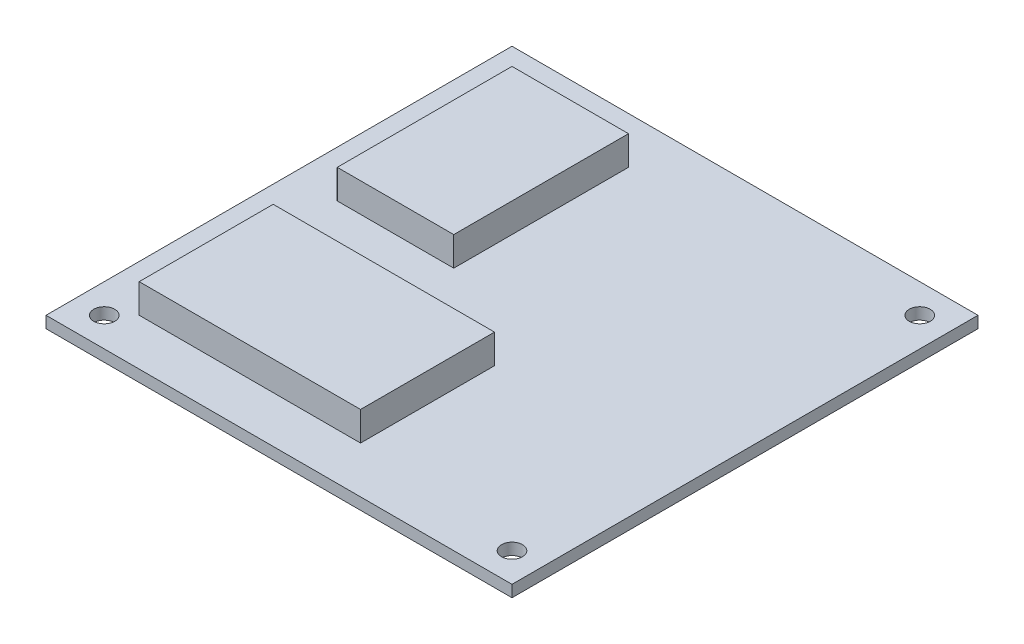
ISO-10303-21;
HEADER;
FILE_DESCRIPTION(('STEP AP214'),'2;1');
FILE_NAME('part.step','',(''),(''),'','','');
FILE_SCHEMA(('AUTOMOTIVE_DESIGN { 1 0 10303 214 1 1 1 1 }'));
ENDSEC;
DATA;
#1=APPLICATION_CONTEXT('core data for automotive mechanical design processes');
#2=APPLICATION_PROTOCOL_DEFINITION('international standard','automotive_design',2000,#1);
#3=PRODUCT_CONTEXT('',#1,'mechanical');
#4=PRODUCT('Part','Part','',(#3));
#5=PRODUCT_RELATED_PRODUCT_CATEGORY('part','',(#4));
#6=PRODUCT_DEFINITION_FORMATION('','',#4);
#7=PRODUCT_DEFINITION_CONTEXT('part definition',#1,'design');
#8=PRODUCT_DEFINITION('design','',#6,#7);
#9=PRODUCT_DEFINITION_SHAPE('','',#8);
#10=(LENGTH_UNIT() NAMED_UNIT(*) SI_UNIT(.MILLI.,.METRE.));
#11=(NAMED_UNIT(*) PLANE_ANGLE_UNIT() SI_UNIT($,.RADIAN.));
#12=(NAMED_UNIT(*) SI_UNIT($,.STERADIAN.) SOLID_ANGLE_UNIT());
#13=UNCERTAINTY_MEASURE_WITH_UNIT(LENGTH_MEASURE(1.E-05),#10,'distance_accuracy_value','');
#14=(GEOMETRIC_REPRESENTATION_CONTEXT(3) GLOBAL_UNCERTAINTY_ASSIGNED_CONTEXT((#13)) GLOBAL_UNIT_ASSIGNED_CONTEXT((#10,
#11,#12)) REPRESENTATION_CONTEXT('',''));
#15=CARTESIAN_POINT('',(0.,0.,0.));
#16=DIRECTION('',(0.,0.,1.));
#17=DIRECTION('',(1.,0.,0.));
#18=AXIS2_PLACEMENT_3D('',#15,#16,#17);
#19=CARTESIAN_POINT('',(0.,2.,0.));
#20=DIRECTION('',(0.,-1.,0.));
#21=DIRECTION('',(0.,0.,-1.));
#22=AXIS2_PLACEMENT_3D('',#19,#20,#21);
#23=PLANE('',#22);
#24=DIRECTION('',(0.,0.,1.));
#25=VECTOR('',#24,1.);
#26=CARTESIAN_POINT('',(8.,2.,-72.));
#27=LINE('',#26,#25);
#28=CARTESIAN_POINT('',(8.,2.,-72.));
#29=VERTEX_POINT('',#28);
#30=CARTESIAN_POINT('',(8.00000000000001,2.,-42.));
#31=VERTEX_POINT('',#30);
#32=EDGE_CURVE('E143',#29,#31,#27,.T.);
#33=ORIENTED_EDGE('',*,*,#32,.F.);
#34=DIRECTION('',(-1.,0.,0.));
#35=VECTOR('',#34,1.);
#36=CARTESIAN_POINT('',(8.,2.,-72.));
#37=LINE('',#36,#35);
#38=CARTESIAN_POINT('',(28.,2.,-72.));
#39=VERTEX_POINT('',#38);
#40=EDGE_CURVE('E156',#39,#29,#37,.T.);
#41=ORIENTED_EDGE('',*,*,#40,.F.);
#42=DIRECTION('',(0.,0.,-1.));
#43=VECTOR('',#42,1.);
#44=CARTESIAN_POINT('',(28.,2.,-72.));
#45=LINE('',#44,#43);
#46=CARTESIAN_POINT('',(28.,2.,-42.));
#47=VERTEX_POINT('',#46);
#48=EDGE_CURVE('E165',#47,#39,#45,.T.);
#49=ORIENTED_EDGE('',*,*,#48,.F.);
#50=DIRECTION('',(1.,0.,0.));
#51=VECTOR('',#50,1.);
#52=CARTESIAN_POINT('',(8.00000000000001,2.,-42.));
#53=LINE('',#52,#51);
#54=EDGE_CURVE('E146',#31,#47,#53,.T.);
#55=ORIENTED_EDGE('',*,*,#54,.F.);
#56=EDGE_LOOP('',(#33,#41,#49,#55));
#57=FACE_BOUND('',#56,.T.);
#58=CARTESIAN_POINT('',(75.,2.,-75.));
#59=DIRECTION('',(0.,1.,0.));
#60=DIRECTION('',(0.,0.,1.));
#61=AXIS2_PLACEMENT_3D('',#58,#59,#60);
#62=CIRCLE('',#61,1.8);
#63=CARTESIAN_POINT('',(75.,2.,-73.2));
#64=VERTEX_POINT('',#63);
#65=EDGE_CURVE('E184',#64,#64,#62,.T.);
#66=ORIENTED_EDGE('',*,*,#65,.F.);
#67=EDGE_LOOP('',(#66));
#68=FACE_BOUND('',#67,.T.);
#69=CARTESIAN_POINT('',(5.,2.,-75.));
#70=DIRECTION('',(0.,1.,0.));
#71=DIRECTION('',(0.,0.,1.));
#72=AXIS2_PLACEMENT_3D('',#69,#70,#71);
#73=CIRCLE('',#72,1.8);
#74=CARTESIAN_POINT('',(5.,2.,-73.2));
#75=VERTEX_POINT('',#74);
#76=EDGE_CURVE('E187',#75,#75,#73,.T.);
#77=ORIENTED_EDGE('',*,*,#76,.F.);
#78=EDGE_LOOP('',(#77));
#79=FACE_BOUND('',#78,.T.);
#80=DIRECTION('',(0.,0.,1.));
#81=VECTOR('',#80,1.);
#82=CARTESIAN_POINT('',(0.,2.,0.));
#83=LINE('',#82,#81);
#84=CARTESIAN_POINT('',(0.,2.,-80.));
#85=VERTEX_POINT('',#84);
#86=CARTESIAN_POINT('',(0.,2.,0.));
#87=VERTEX_POINT('',#86);
#88=EDGE_CURVE('E194',#85,#87,#83,.T.);
#89=ORIENTED_EDGE('',*,*,#88,.T.);
#90=DIRECTION('',(1.,0.,0.));
#91=VECTOR('',#90,1.);
#92=CARTESIAN_POINT('',(0.,2.,0.));
#93=LINE('',#92,#91);
#94=CARTESIAN_POINT('',(80.,2.,0.));
#95=VERTEX_POINT('',#94);
#96=EDGE_CURVE('E197',#87,#95,#93,.T.);
#97=ORIENTED_EDGE('',*,*,#96,.T.);
#98=DIRECTION('',(0.,0.,-1.));
#99=VECTOR('',#98,1.);
#100=CARTESIAN_POINT('',(80.,2.,0.));
#101=LINE('',#100,#99);
#102=CARTESIAN_POINT('',(80.,2.,-80.));
#103=VERTEX_POINT('',#102);
#104=EDGE_CURVE('E200',#95,#103,#101,.T.);
#105=ORIENTED_EDGE('',*,*,#104,.T.);
#106=DIRECTION('',(-1.,0.,0.));
#107=VECTOR('',#106,1.);
#108=CARTESIAN_POINT('',(0.,2.,-80.));
#109=LINE('',#108,#107);
#110=EDGE_CURVE('E202',#103,#85,#109,.T.);
#111=ORIENTED_EDGE('',*,*,#110,.T.);
#112=EDGE_LOOP('',(#89,#97,#105,#111));
#113=FACE_BOUND('',#112,.T.);
#114=CARTESIAN_POINT('',(5.,2.,-4.99999999999999));
#115=DIRECTION('',(0.,1.,0.));
#116=DIRECTION('',(0.,0.,1.));
#117=AXIS2_PLACEMENT_3D('',#114,#115,#116);
#118=CIRCLE('',#117,1.8);
#119=CARTESIAN_POINT('',(5.,2.,-3.19999999999999));
#120=VERTEX_POINT('',#119);
#121=EDGE_CURVE('E226',#120,#120,#118,.T.);
#122=ORIENTED_EDGE('',*,*,#121,.F.);
#123=EDGE_LOOP('',(#122));
#124=FACE_BOUND('',#123,.T.);
#125=CARTESIAN_POINT('',(75.,2.,-4.99999999999999));
#126=DIRECTION('',(0.,1.,0.));
#127=DIRECTION('',(0.,0.,1.));
#128=AXIS2_PLACEMENT_3D('',#125,#126,#127);
#129=CIRCLE('',#128,1.8);
#130=CARTESIAN_POINT('',(75.,2.,-3.19999999999999));
#131=VERTEX_POINT('',#130);
#132=EDGE_CURVE('E11',#131,#131,#129,.T.);
#133=ORIENTED_EDGE('',*,*,#132,.F.);
#134=EDGE_LOOP('',(#133));
#135=FACE_BOUND('',#134,.T.);
#136=DIRECTION('',(0.,0.,1.));
#137=VECTOR('',#136,1.);
#138=CARTESIAN_POINT('',(7.99999999999999,2.,-31.));
#139=LINE('',#138,#137);
#140=CARTESIAN_POINT('',(7.99999999999999,2.,-31.));
#141=VERTEX_POINT('',#140);
#142=CARTESIAN_POINT('',(8.,2.,-8.));
#143=VERTEX_POINT('',#142);
#144=EDGE_CURVE('E142',#141,#143,#139,.T.);
#145=ORIENTED_EDGE('',*,*,#144,.F.);
#146=DIRECTION('',(-1.,0.,0.));
#147=VECTOR('',#146,1.);
#148=CARTESIAN_POINT('',(7.99999999999999,2.,-31.));
#149=LINE('',#148,#147);
#150=CARTESIAN_POINT('',(46.,2.,-31.));
#151=VERTEX_POINT('',#150);
#152=EDGE_CURVE('E139',#151,#141,#149,.T.);
#153=ORIENTED_EDGE('',*,*,#152,.F.);
#154=DIRECTION('',(0.,0.,-1.));
#155=VECTOR('',#154,1.);
#156=CARTESIAN_POINT('',(46.,2.,-31.));
#157=LINE('',#156,#155);
#158=CARTESIAN_POINT('',(46.,2.,-8.));
#159=VERTEX_POINT('',#158);
#160=EDGE_CURVE('E53',#159,#151,#157,.T.);
#161=ORIENTED_EDGE('',*,*,#160,.F.);
#162=DIRECTION('',(1.,0.,0.));
#163=VECTOR('',#162,1.);
#164=CARTESIAN_POINT('',(8.,2.,-8.));
#165=LINE('',#164,#163);
#166=EDGE_CURVE('E48',#143,#159,#165,.T.);
#167=ORIENTED_EDGE('',*,*,#166,.F.);
#168=EDGE_LOOP('',(#145,#153,#161,#167));
#169=FACE_BOUND('',#168,.T.);
#170=ADVANCED_FACE('F33',(#57,#68,#79,#113,#124,#135,#169),#23,.F.);
#171=CARTESIAN_POINT('',(0.,2.,0.));
#172=DIRECTION('',(1.,0.,0.));
#173=DIRECTION('',(0.,0.,-1.));
#174=AXIS2_PLACEMENT_3D('',#171,#172,#173);
#175=PLANE('',#174);
#176=DIRECTION('',(0.,0.,1.));
#177=VECTOR('',#176,1.);
#178=CARTESIAN_POINT('',(0.,0.,0.));
#179=LINE('',#178,#177);
#180=CARTESIAN_POINT('',(0.,0.,-80.));
#181=VERTEX_POINT('',#180);
#182=CARTESIAN_POINT('',(0.,0.,0.));
#183=VERTEX_POINT('',#182);
#184=EDGE_CURVE('E191',#181,#183,#179,.T.);
#185=ORIENTED_EDGE('',*,*,#184,.T.);
#186=DIRECTION('',(0.,-1.,0.));
#187=VECTOR('',#186,1.);
#188=CARTESIAN_POINT('',(0.,2.,0.));
#189=LINE('',#188,#187);
#190=EDGE_CURVE('E220',#87,#183,#189,.T.);
#191=ORIENTED_EDGE('',*,*,#190,.F.);
#192=ORIENTED_EDGE('',*,*,#88,.F.);
#193=DIRECTION('',(0.,-1.,0.));
#194=VECTOR('',#193,1.);
#195=CARTESIAN_POINT('',(0.,2.,-80.));
#196=LINE('',#195,#194);
#197=EDGE_CURVE('E204',#85,#181,#196,.T.);
#198=ORIENTED_EDGE('',*,*,#197,.T.);
#199=EDGE_LOOP('',(#185,#191,#192,#198));
#200=FACE_BOUND('',#199,.T.);
#201=ADVANCED_FACE('F240',(#200),#175,.F.);
#202=CARTESIAN_POINT('',(0.,2.,0.));
#203=DIRECTION('',(0.,0.,-1.));
#204=DIRECTION('',(-1.,0.,0.));
#205=AXIS2_PLACEMENT_3D('',#202,#203,#204);
#206=PLANE('',#205);
#207=DIRECTION('',(1.,0.,0.));
#208=VECTOR('',#207,1.);
#209=CARTESIAN_POINT('',(0.,0.,0.));
#210=LINE('',#209,#208);
#211=CARTESIAN_POINT('',(80.,0.,0.));
#212=VERTEX_POINT('',#211);
#213=EDGE_CURVE('E207',#183,#212,#210,.T.);
#214=ORIENTED_EDGE('',*,*,#213,.T.);
#215=DIRECTION('',(0.,-1.,0.));
#216=VECTOR('',#215,1.);
#217=CARTESIAN_POINT('',(80.,2.,0.));
#218=LINE('',#217,#216);
#219=EDGE_CURVE('E217',#95,#212,#218,.T.);
#220=ORIENTED_EDGE('',*,*,#219,.F.);
#221=ORIENTED_EDGE('',*,*,#96,.F.);
#222=ORIENTED_EDGE('',*,*,#190,.T.);
#223=EDGE_LOOP('',(#214,#220,#221,#222));
#224=FACE_BOUND('',#223,.T.);
#225=ADVANCED_FACE('F307',(#224),#206,.F.);
#226=CARTESIAN_POINT('',(80.,2.,0.));
#227=DIRECTION('',(-1.,0.,0.));
#228=DIRECTION('',(0.,0.,1.));
#229=AXIS2_PLACEMENT_3D('',#226,#227,#228);
#230=PLANE('',#229);
#231=DIRECTION('',(0.,0.,-1.));
#232=VECTOR('',#231,1.);
#233=CARTESIAN_POINT('',(80.,0.,0.));
#234=LINE('',#233,#232);
#235=CARTESIAN_POINT('',(80.,0.,-80.));
#236=VERTEX_POINT('',#235);
#237=EDGE_CURVE('E209',#212,#236,#234,.T.);
#238=ORIENTED_EDGE('',*,*,#237,.T.);
#239=DIRECTION('',(0.,-1.,0.));
#240=VECTOR('',#239,1.);
#241=CARTESIAN_POINT('',(80.,2.,-80.));
#242=LINE('',#241,#240);
#243=EDGE_CURVE('E214',#103,#236,#242,.T.);
#244=ORIENTED_EDGE('',*,*,#243,.F.);
#245=ORIENTED_EDGE('',*,*,#104,.F.);
#246=ORIENTED_EDGE('',*,*,#219,.T.);
#247=EDGE_LOOP('',(#238,#244,#245,#246));
#248=FACE_BOUND('',#247,.T.);
#249=ADVANCED_FACE('F303',(#248),#230,.F.);
#250=CARTESIAN_POINT('',(0.,2.,-80.));
#251=DIRECTION('',(0.,0.,1.));
#252=DIRECTION('',(1.,0.,0.));
#253=AXIS2_PLACEMENT_3D('',#250,#251,#252);
#254=PLANE('',#253);
#255=DIRECTION('',(-1.,0.,0.));
#256=VECTOR('',#255,1.);
#257=CARTESIAN_POINT('',(0.,0.,-80.));
#258=LINE('',#257,#256);
#259=EDGE_CURVE('E198',#236,#181,#258,.T.);
#260=ORIENTED_EDGE('',*,*,#259,.T.);
#261=ORIENTED_EDGE('',*,*,#197,.F.);
#262=ORIENTED_EDGE('',*,*,#110,.F.);
#263=ORIENTED_EDGE('',*,*,#243,.T.);
#264=EDGE_LOOP('',(#260,#261,#262,#263));
#265=FACE_BOUND('',#264,.T.);
#266=ADVANCED_FACE('F299',(#265),#254,.F.);
#267=CARTESIAN_POINT('',(0.,0.,0.));
#268=DIRECTION('',(0.,-1.,0.));
#269=DIRECTION('',(0.,0.,-1.));
#270=AXIS2_PLACEMENT_3D('',#267,#268,#269);
#271=PLANE('',#270);
#272=CARTESIAN_POINT('',(75.,0.,-75.));
#273=DIRECTION('',(0.,1.,0.));
#274=DIRECTION('',(0.,0.,1.));
#275=AXIS2_PLACEMENT_3D('',#272,#273,#274);
#276=CIRCLE('',#275,1.8);
#277=CARTESIAN_POINT('',(75.,0.,-73.2));
#278=VERTEX_POINT('',#277);
#279=EDGE_CURVE('E181',#278,#278,#276,.T.);
#280=ORIENTED_EDGE('',*,*,#279,.T.);
#281=EDGE_LOOP('',(#280));
#282=FACE_BOUND('',#281,.T.);
#283=CARTESIAN_POINT('',(5.,0.,-75.));
#284=DIRECTION('',(0.,1.,0.));
#285=DIRECTION('',(0.,0.,1.));
#286=AXIS2_PLACEMENT_3D('',#283,#284,#285);
#287=CIRCLE('',#286,1.8);
#288=CARTESIAN_POINT('',(5.,0.,-73.2));
#289=VERTEX_POINT('',#288);
#290=EDGE_CURVE('E188',#289,#289,#287,.T.);
#291=ORIENTED_EDGE('',*,*,#290,.T.);
#292=EDGE_LOOP('',(#291));
#293=FACE_BOUND('',#292,.T.);
#294=ORIENTED_EDGE('',*,*,#184,.F.);
#295=ORIENTED_EDGE('',*,*,#259,.F.);
#296=ORIENTED_EDGE('',*,*,#237,.F.);
#297=ORIENTED_EDGE('',*,*,#213,.F.);
#298=EDGE_LOOP('',(#294,#295,#296,#297));
#299=FACE_BOUND('',#298,.T.);
#300=CARTESIAN_POINT('',(5.,0.,-4.99999999999999));
#301=DIRECTION('',(0.,1.,0.));
#302=DIRECTION('',(0.,0.,1.));
#303=AXIS2_PLACEMENT_3D('',#300,#301,#302);
#304=CIRCLE('',#303,1.8);
#305=CARTESIAN_POINT('',(5.,0.,-3.19999999999999));
#306=VERTEX_POINT('',#305);
#307=EDGE_CURVE('E223',#306,#306,#304,.T.);
#308=ORIENTED_EDGE('',*,*,#307,.T.);
#309=EDGE_LOOP('',(#308));
#310=FACE_BOUND('',#309,.T.);
#311=CARTESIAN_POINT('',(75.,0.,-4.99999999999999));
#312=DIRECTION('',(0.,1.,0.));
#313=DIRECTION('',(0.,0.,1.));
#314=AXIS2_PLACEMENT_3D('',#311,#312,#313);
#315=CIRCLE('',#314,1.8);
#316=CARTESIAN_POINT('',(75.,0.,-3.19999999999999));
#317=VERTEX_POINT('',#316);
#318=EDGE_CURVE('E41',#317,#317,#315,.T.);
#319=ORIENTED_EDGE('',*,*,#318,.T.);
#320=EDGE_LOOP('',(#319));
#321=FACE_BOUND('',#320,.T.);
#322=ADVANCED_FACE('F231',(#282,#293,#299,#310,#321),#271,.T.);
#323=CARTESIAN_POINT('',(5.,0.,-75.));
#324=DIRECTION('',(0.,1.,0.));
#325=DIRECTION('',(0.,0.,1.));
#326=AXIS2_PLACEMENT_3D('',#323,#324,#325);
#327=CYLINDRICAL_SURFACE('',#326,1.8);
#328=ORIENTED_EDGE('',*,*,#290,.F.);
#329=EDGE_LOOP('',(#328));
#330=FACE_BOUND('',#329,.T.);
#331=ORIENTED_EDGE('',*,*,#76,.T.);
#332=EDGE_LOOP('',(#331));
#333=FACE_BOUND('',#332,.T.);
#334=ADVANCED_FACE('F292',(#330,#333),#327,.F.);
#335=CARTESIAN_POINT('',(75.,0.,-75.));
#336=DIRECTION('',(0.,1.,0.));
#337=DIRECTION('',(0.,0.,1.));
#338=AXIS2_PLACEMENT_3D('',#335,#336,#337);
#339=CYLINDRICAL_SURFACE('',#338,1.8);
#340=ORIENTED_EDGE('',*,*,#279,.F.);
#341=EDGE_LOOP('',(#340));
#342=FACE_BOUND('',#341,.T.);
#343=ORIENTED_EDGE('',*,*,#65,.T.);
#344=EDGE_LOOP('',(#343));
#345=FACE_BOUND('',#344,.T.);
#346=ADVANCED_FACE('F289',(#342,#345),#339,.F.);
#347=CARTESIAN_POINT('',(5.,0.,-4.99999999999999));
#348=DIRECTION('',(0.,1.,0.));
#349=DIRECTION('',(0.,0.,1.));
#350=AXIS2_PLACEMENT_3D('',#347,#348,#349);
#351=CYLINDRICAL_SURFACE('',#350,1.8);
#352=ORIENTED_EDGE('',*,*,#307,.F.);
#353=EDGE_LOOP('',(#352));
#354=FACE_BOUND('',#353,.T.);
#355=ORIENTED_EDGE('',*,*,#121,.T.);
#356=EDGE_LOOP('',(#355));
#357=FACE_BOUND('',#356,.T.);
#358=ADVANCED_FACE('F236',(#354,#357),#351,.F.);
#359=CARTESIAN_POINT('',(75.,0.,-4.99999999999999));
#360=DIRECTION('',(0.,1.,0.));
#361=DIRECTION('',(0.,0.,1.));
#362=AXIS2_PLACEMENT_3D('',#359,#360,#361);
#363=CYLINDRICAL_SURFACE('',#362,1.8);
#364=ORIENTED_EDGE('',*,*,#318,.F.);
#365=EDGE_LOOP('',(#364));
#366=FACE_BOUND('',#365,.T.);
#367=ORIENTED_EDGE('',*,*,#132,.T.);
#368=EDGE_LOOP('',(#367));
#369=FACE_BOUND('',#368,.T.);
#370=ADVANCED_FACE('F35',(#366,#369),#363,.F.);
#371=CARTESIAN_POINT('',(8.,7.,-72.));
#372=DIRECTION('',(1.,0.,0.));
#373=DIRECTION('',(0.,0.,-1.));
#374=AXIS2_PLACEMENT_3D('',#371,#372,#373);
#375=PLANE('',#374);
#376=ORIENTED_EDGE('',*,*,#32,.T.);
#377=DIRECTION('',(0.,-1.,0.));
#378=VECTOR('',#377,1.);
#379=CARTESIAN_POINT('',(8.00000000000001,7.,-42.));
#380=LINE('',#379,#378);
#381=CARTESIAN_POINT('',(8.00000000000001,7.,-42.));
#382=VERTEX_POINT('',#381);
#383=EDGE_CURVE('E178',#382,#31,#380,.T.);
#384=ORIENTED_EDGE('',*,*,#383,.F.);
#385=DIRECTION('',(0.,0.,1.));
#386=VECTOR('',#385,1.);
#387=CARTESIAN_POINT('',(8.,7.,-72.));
#388=LINE('',#387,#386);
#389=CARTESIAN_POINT('',(8.,7.,-72.));
#390=VERTEX_POINT('',#389);
#391=EDGE_CURVE('E152',#390,#382,#388,.T.);
#392=ORIENTED_EDGE('',*,*,#391,.F.);
#393=DIRECTION('',(0.,-1.,0.));
#394=VECTOR('',#393,1.);
#395=CARTESIAN_POINT('',(8.,7.,-72.));
#396=LINE('',#395,#394);
#397=EDGE_CURVE('E161',#390,#29,#396,.T.);
#398=ORIENTED_EDGE('',*,*,#397,.T.);
#399=EDGE_LOOP('',(#376,#384,#392,#398));
#400=FACE_BOUND('',#399,.T.);
#401=ADVANCED_FACE('F235',(#400),#375,.F.);
#402=CARTESIAN_POINT('',(8.00000000000001,7.,-42.));
#403=DIRECTION('',(0.,0.,-1.));
#404=DIRECTION('',(-1.,0.,0.));
#405=AXIS2_PLACEMENT_3D('',#402,#403,#404);
#406=PLANE('',#405);
#407=ORIENTED_EDGE('',*,*,#54,.T.);
#408=DIRECTION('',(0.,-1.,0.));
#409=VECTOR('',#408,1.);
#410=CARTESIAN_POINT('',(28.,7.,-42.));
#411=LINE('',#410,#409);
#412=CARTESIAN_POINT('',(28.,7.,-42.));
#413=VERTEX_POINT('',#412);
#414=EDGE_CURVE('E175',#413,#47,#411,.T.);
#415=ORIENTED_EDGE('',*,*,#414,.F.);
#416=DIRECTION('',(1.,0.,0.));
#417=VECTOR('',#416,1.);
#418=CARTESIAN_POINT('',(8.00000000000001,7.,-42.));
#419=LINE('',#418,#417);
#420=EDGE_CURVE('E155',#382,#413,#419,.T.);
#421=ORIENTED_EDGE('',*,*,#420,.F.);
#422=ORIENTED_EDGE('',*,*,#383,.T.);
#423=EDGE_LOOP('',(#407,#415,#421,#422));
#424=FACE_BOUND('',#423,.T.);
#425=ADVANCED_FACE('F281',(#424),#406,.F.);
#426=CARTESIAN_POINT('',(28.,7.,-72.));
#427=DIRECTION('',(-1.,0.,0.));
#428=DIRECTION('',(0.,0.,1.));
#429=AXIS2_PLACEMENT_3D('',#426,#427,#428);
#430=PLANE('',#429);
#431=ORIENTED_EDGE('',*,*,#48,.T.);
#432=DIRECTION('',(0.,-1.,0.));
#433=VECTOR('',#432,1.);
#434=CARTESIAN_POINT('',(28.,7.,-72.));
#435=LINE('',#434,#433);
#436=CARTESIAN_POINT('',(28.,7.,-72.));
#437=VERTEX_POINT('',#436);
#438=EDGE_CURVE('E172',#437,#39,#435,.T.);
#439=ORIENTED_EDGE('',*,*,#438,.F.);
#440=DIRECTION('',(0.,0.,-1.));
#441=VECTOR('',#440,1.);
#442=CARTESIAN_POINT('',(28.,7.,-72.));
#443=LINE('',#442,#441);
#444=EDGE_CURVE('E158',#413,#437,#443,.T.);
#445=ORIENTED_EDGE('',*,*,#444,.F.);
#446=ORIENTED_EDGE('',*,*,#414,.T.);
#447=EDGE_LOOP('',(#431,#439,#445,#446));
#448=FACE_BOUND('',#447,.T.);
#449=ADVANCED_FACE('F277',(#448),#430,.F.);
#450=CARTESIAN_POINT('',(8.,7.,-72.));
#451=DIRECTION('',(0.,0.,1.));
#452=DIRECTION('',(1.,0.,0.));
#453=AXIS2_PLACEMENT_3D('',#450,#451,#452);
#454=PLANE('',#453);
#455=ORIENTED_EDGE('',*,*,#40,.T.);
#456=ORIENTED_EDGE('',*,*,#397,.F.);
#457=DIRECTION('',(-1.,0.,0.));
#458=VECTOR('',#457,1.);
#459=CARTESIAN_POINT('',(8.,7.,-72.));
#460=LINE('',#459,#458);
#461=EDGE_CURVE('E160',#437,#390,#460,.T.);
#462=ORIENTED_EDGE('',*,*,#461,.F.);
#463=ORIENTED_EDGE('',*,*,#438,.T.);
#464=EDGE_LOOP('',(#455,#456,#462,#463));
#465=FACE_BOUND('',#464,.T.);
#466=ADVANCED_FACE('F273',(#465),#454,.F.);
#467=CARTESIAN_POINT('',(0.,7.,0.));
#468=DIRECTION('',(0.,1.,0.));
#469=DIRECTION('',(0.,0.,1.));
#470=AXIS2_PLACEMENT_3D('',#467,#468,#469);
#471=PLANE('',#470);
#472=ORIENTED_EDGE('',*,*,#391,.T.);
#473=ORIENTED_EDGE('',*,*,#420,.T.);
#474=ORIENTED_EDGE('',*,*,#444,.T.);
#475=ORIENTED_EDGE('',*,*,#461,.T.);
#476=EDGE_LOOP('',(#472,#473,#474,#475));
#477=FACE_BOUND('',#476,.T.);
#478=ADVANCED_FACE('F270',(#477),#471,.T.);
#479=CARTESIAN_POINT('',(7.99999999999999,7.,-31.));
#480=DIRECTION('',(1.,0.,0.));
#481=DIRECTION('',(0.,0.,-1.));
#482=AXIS2_PLACEMENT_3D('',#479,#480,#481);
#483=PLANE('',#482);
#484=ORIENTED_EDGE('',*,*,#144,.T.);
#485=DIRECTION('',(0.,-1.,0.));
#486=VECTOR('',#485,1.);
#487=CARTESIAN_POINT('',(8.,7.,-8.));
#488=LINE('',#487,#486);
#489=CARTESIAN_POINT('',(8.,7.,-8.));
#490=VERTEX_POINT('',#489);
#491=EDGE_CURVE('E123',#490,#143,#488,.T.);
#492=ORIENTED_EDGE('',*,*,#491,.F.);
#493=DIRECTION('',(0.,0.,1.));
#494=VECTOR('',#493,1.);
#495=CARTESIAN_POINT('',(7.99999999999999,7.,-31.));
#496=LINE('',#495,#494);
#497=CARTESIAN_POINT('',(7.99999999999999,7.,-31.));
#498=VERTEX_POINT('',#497);
#499=EDGE_CURVE('E130',#498,#490,#496,.T.);
#500=ORIENTED_EDGE('',*,*,#499,.F.);
#501=DIRECTION('',(0.,-1.,0.));
#502=VECTOR('',#501,1.);
#503=CARTESIAN_POINT('',(7.99999999999999,7.,-31.));
#504=LINE('',#503,#502);
#505=EDGE_CURVE('E248',#498,#141,#504,.T.);
#506=ORIENTED_EDGE('',*,*,#505,.T.);
#507=EDGE_LOOP('',(#484,#492,#500,#506));
#508=FACE_BOUND('',#507,.T.);
#509=ADVANCED_FACE('F141',(#508),#483,.F.);
#510=CARTESIAN_POINT('',(8.,7.,-8.));
#511=DIRECTION('',(0.,0.,-1.));
#512=DIRECTION('',(-1.,0.,0.));
#513=AXIS2_PLACEMENT_3D('',#510,#511,#512);
#514=PLANE('',#513);
#515=ORIENTED_EDGE('',*,*,#166,.T.);
#516=DIRECTION('',(0.,-1.,0.));
#517=VECTOR('',#516,1.);
#518=CARTESIAN_POINT('',(46.,7.,-8.));
#519=LINE('',#518,#517);
#520=CARTESIAN_POINT('',(46.,7.,-8.));
#521=VERTEX_POINT('',#520);
#522=EDGE_CURVE('E126',#521,#159,#519,.T.);
#523=ORIENTED_EDGE('',*,*,#522,.F.);
#524=DIRECTION('',(1.,0.,0.));
#525=VECTOR('',#524,1.);
#526=CARTESIAN_POINT('',(8.,7.,-8.));
#527=LINE('',#526,#525);
#528=EDGE_CURVE('E119',#490,#521,#527,.T.);
#529=ORIENTED_EDGE('',*,*,#528,.F.);
#530=ORIENTED_EDGE('',*,*,#491,.T.);
#531=EDGE_LOOP('',(#515,#523,#529,#530));
#532=FACE_BOUND('',#531,.T.);
#533=ADVANCED_FACE('F121',(#532),#514,.F.);
#534=CARTESIAN_POINT('',(46.,7.,-31.));
#535=DIRECTION('',(-1.,0.,0.));
#536=DIRECTION('',(0.,0.,1.));
#537=AXIS2_PLACEMENT_3D('',#534,#535,#536);
#538=PLANE('',#537);
#539=ORIENTED_EDGE('',*,*,#160,.T.);
#540=DIRECTION('',(0.,-1.,0.));
#541=VECTOR('',#540,1.);
#542=CARTESIAN_POINT('',(46.,7.,-31.));
#543=LINE('',#542,#541);
#544=CARTESIAN_POINT('',(46.,7.,-31.));
#545=VERTEX_POINT('',#544);
#546=EDGE_CURVE('E148',#545,#151,#543,.T.);
#547=ORIENTED_EDGE('',*,*,#546,.F.);
#548=DIRECTION('',(0.,0.,-1.));
#549=VECTOR('',#548,1.);
#550=CARTESIAN_POINT('',(46.,7.,-31.));
#551=LINE('',#550,#549);
#552=EDGE_CURVE('E129',#521,#545,#551,.T.);
#553=ORIENTED_EDGE('',*,*,#552,.F.);
#554=ORIENTED_EDGE('',*,*,#522,.T.);
#555=EDGE_LOOP('',(#539,#547,#553,#554));
#556=FACE_BOUND('',#555,.T.);
#557=ADVANCED_FACE('F257',(#556),#538,.F.);
#558=CARTESIAN_POINT('',(7.99999999999999,7.,-31.));
#559=DIRECTION('',(0.,0.,1.));
#560=DIRECTION('',(1.,0.,0.));
#561=AXIS2_PLACEMENT_3D('',#558,#559,#560);
#562=PLANE('',#561);
#563=ORIENTED_EDGE('',*,*,#152,.T.);
#564=ORIENTED_EDGE('',*,*,#505,.F.);
#565=DIRECTION('',(-1.,0.,0.));
#566=VECTOR('',#565,1.);
#567=CARTESIAN_POINT('',(7.99999999999999,7.,-31.));
#568=LINE('',#567,#566);
#569=EDGE_CURVE('E135',#545,#498,#568,.T.);
#570=ORIENTED_EDGE('',*,*,#569,.F.);
#571=ORIENTED_EDGE('',*,*,#546,.T.);
#572=EDGE_LOOP('',(#563,#564,#570,#571));
#573=FACE_BOUND('',#572,.T.);
#574=ADVANCED_FACE('F247',(#573),#562,.F.);
#575=CARTESIAN_POINT('',(0.,7.,0.));
#576=DIRECTION('',(0.,1.,0.));
#577=DIRECTION('',(0.,0.,1.));
#578=AXIS2_PLACEMENT_3D('',#575,#576,#577);
#579=PLANE('',#578);
#580=ORIENTED_EDGE('',*,*,#499,.T.);
#581=ORIENTED_EDGE('',*,*,#528,.T.);
#582=ORIENTED_EDGE('',*,*,#552,.T.);
#583=ORIENTED_EDGE('',*,*,#569,.T.);
#584=EDGE_LOOP('',(#580,#581,#582,#583));
#585=FACE_BOUND('',#584,.T.);
#586=ADVANCED_FACE('F133',(#585),#579,.T.);
#587=CLOSED_SHELL('',(#170,#201,#225,#249,#266,#322,#334,#346,#358,#370,#401,#425,#449,#466,
#478,#509,#533,#557,#574,#586));
#588=MANIFOLD_SOLID_BREP('B2',#587);
#589=ADVANCED_BREP_SHAPE_REPRESENTATION('',(#18,#588),#14);
#590=SHAPE_DEFINITION_REPRESENTATION(#9,#589);
ENDSEC;
END-ISO-10303-21;
